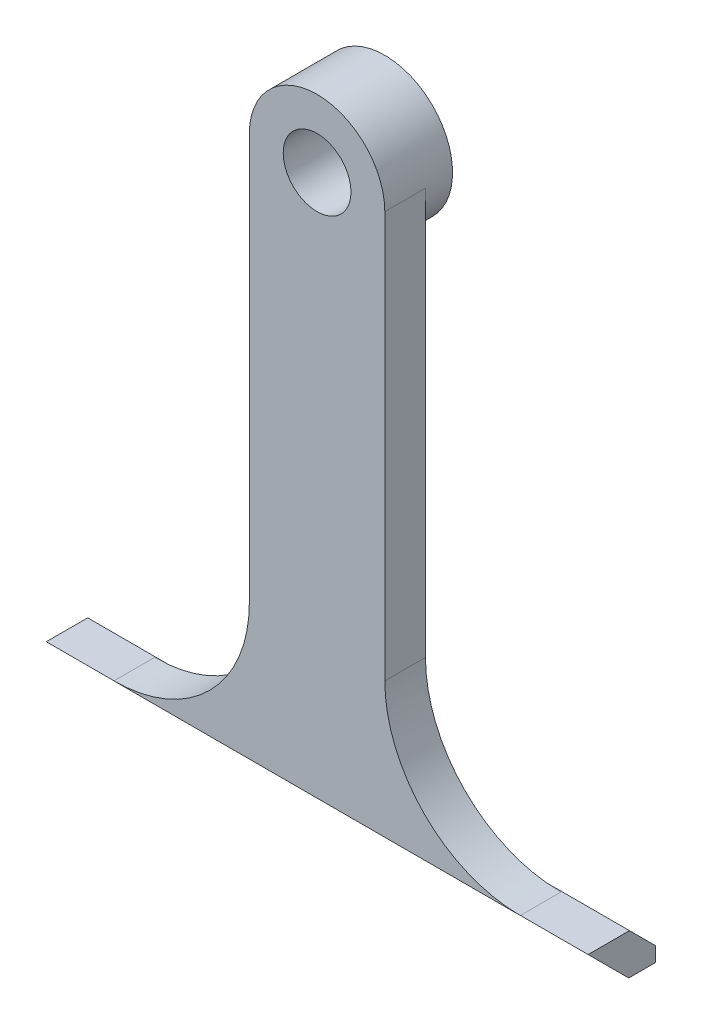
ISO-10303-21;
HEADER;
FILE_DESCRIPTION(('STEP AP214'),'2;1');
FILE_NAME('part.step','',(''),(''),'','','');
FILE_SCHEMA(('AUTOMOTIVE_DESIGN { 1 0 10303 214 1 1 1 1 }'));
ENDSEC;
DATA;
#1=APPLICATION_CONTEXT('core data for automotive mechanical design processes');
#2=APPLICATION_PROTOCOL_DEFINITION('international standard','automotive_design',2000,#1);
#3=PRODUCT_CONTEXT('',#1,'mechanical');
#4=PRODUCT('Part','Part','',(#3));
#5=PRODUCT_RELATED_PRODUCT_CATEGORY('part','',(#4));
#6=PRODUCT_DEFINITION_FORMATION('','',#4);
#7=PRODUCT_DEFINITION_CONTEXT('part definition',#1,'design');
#8=PRODUCT_DEFINITION('design','',#6,#7);
#9=PRODUCT_DEFINITION_SHAPE('','',#8);
#10=(LENGTH_UNIT() NAMED_UNIT(*) SI_UNIT(.MILLI.,.METRE.));
#11=(NAMED_UNIT(*) PLANE_ANGLE_UNIT() SI_UNIT($,.RADIAN.));
#12=(NAMED_UNIT(*) SI_UNIT($,.STERADIAN.) SOLID_ANGLE_UNIT());
#13=UNCERTAINTY_MEASURE_WITH_UNIT(LENGTH_MEASURE(1.E-05),#10,'distance_accuracy_value','');
#14=(GEOMETRIC_REPRESENTATION_CONTEXT(3) GLOBAL_UNCERTAINTY_ASSIGNED_CONTEXT((#13)) GLOBAL_UNIT_ASSIGNED_CONTEXT((#10,
#11,#12)) REPRESENTATION_CONTEXT('',''));
#15=CARTESIAN_POINT('',(0.,0.,0.));
#16=DIRECTION('',(0.,0.,1.));
#17=DIRECTION('',(1.,0.,0.));
#18=AXIS2_PLACEMENT_3D('',#15,#16,#17);
#19=CARTESIAN_POINT('',(0.,0.,-20.32));
#20=DIRECTION('',(0.,0.,-1.));
#21=DIRECTION('',(-1.,0.,0.));
#22=AXIS2_PLACEMENT_3D('',#19,#20,#21);
#23=PLANE('',#22);
#24=DIRECTION('',(0.,-1.,0.));
#25=VECTOR('',#24,1.);
#26=CARTESIAN_POINT('',(-12.7,0.,-20.32));
#27=LINE('',#26,#25);
#28=CARTESIAN_POINT('',(-12.7,109.22,-20.32));
#29=VERTEX_POINT('',#28);
#30=CARTESIAN_POINT('',(-12.7,33.02,-20.32));
#31=VERTEX_POINT('',#30);
#32=EDGE_CURVE('E262',#29,#31,#27,.T.);
#33=ORIENTED_EDGE('',*,*,#32,.F.);
#34=CARTESIAN_POINT('',(0.,109.22,-20.32));
#35=DIRECTION('',(0.,0.,-1.));
#36=DIRECTION('',(-1.,0.,0.));
#37=AXIS2_PLACEMENT_3D('',#34,#35,#36);
#38=CIRCLE('',#37,12.7);
#39=CARTESIAN_POINT('',(12.7,109.22,-20.32));
#40=VERTEX_POINT('',#39);
#41=EDGE_CURVE('E207',#29,#40,#38,.F.);
#42=ORIENTED_EDGE('',*,*,#41,.T.);
#43=DIRECTION('',(0.,-1.,0.));
#44=VECTOR('',#43,1.);
#45=CARTESIAN_POINT('',(12.7,0.,-20.32));
#46=LINE('',#45,#44);
#47=CARTESIAN_POINT('',(12.7,33.02,-20.32));
#48=VERTEX_POINT('',#47);
#49=EDGE_CURVE('E259',#40,#48,#46,.T.);
#50=ORIENTED_EDGE('',*,*,#49,.T.);
#51=CARTESIAN_POINT('',(38.1,33.02,-20.32));
#52=DIRECTION('',(0.,0.,-1.));
#53=DIRECTION('',(-1.,0.,0.));
#54=AXIS2_PLACEMENT_3D('',#51,#52,#53);
#55=CIRCLE('',#54,25.4);
#56=CARTESIAN_POINT('',(38.1,7.62,-20.32));
#57=VERTEX_POINT('',#56);
#58=EDGE_CURVE('E229',#48,#57,#55,.F.);
#59=ORIENTED_EDGE('',*,*,#58,.T.);
#60=DIRECTION('',(1.,0.,0.));
#61=VECTOR('',#60,1.);
#62=CARTESIAN_POINT('',(0.,7.62,-20.32));
#63=LINE('',#62,#61);
#64=CARTESIAN_POINT('',(-38.1,7.62,-20.32));
#65=VERTEX_POINT('',#64);
#66=EDGE_CURVE('E256',#65,#57,#63,.T.);
#67=ORIENTED_EDGE('',*,*,#66,.F.);
#68=CARTESIAN_POINT('',(-38.1,33.02,-20.32));
#69=DIRECTION('',(0.,0.,-1.));
#70=DIRECTION('',(-1.,0.,0.));
#71=AXIS2_PLACEMENT_3D('',#68,#69,#70);
#72=CIRCLE('',#71,25.4);
#73=EDGE_CURVE('E224',#65,#31,#72,.F.);
#74=ORIENTED_EDGE('',*,*,#73,.T.);
#75=EDGE_LOOP('',(#33,#42,#50,#59,#67,#74));
#76=FACE_BOUND('',#75,.T.);
#77=ADVANCED_FACE('F83',(#76),#23,.T.);
#78=CARTESIAN_POINT('',(25.4,7.62,0.));
#79=DIRECTION('',(0.,1.,0.));
#80=DIRECTION('',(0.,0.,1.));
#81=AXIS2_PLACEMENT_3D('',#78,#79,#80);
#82=PLANE('',#81);
#83=DIRECTION('',(1.,0.,0.));
#84=VECTOR('',#83,1.);
#85=CARTESIAN_POINT('',(-50.8,7.62,-12.7175408770439));
#86=LINE('',#85,#84);
#87=CARTESIAN_POINT('',(38.1,7.62,-12.7175408770439));
#88=VERTEX_POINT('',#87);
#89=CARTESIAN_POINT('',(50.8,7.62,-12.7175408770439));
#90=VERTEX_POINT('',#89);
#91=EDGE_CURVE('E192',#88,#90,#86,.T.);
#92=ORIENTED_EDGE('',*,*,#91,.T.);
#93=DIRECTION('',(0.,0.,1.));
#94=VECTOR('',#93,1.);
#95=CARTESIAN_POINT('',(50.8,7.62,-25.4));
#96=LINE('',#95,#94);
#97=CARTESIAN_POINT('',(50.8,7.62,-20.48));
#98=VERTEX_POINT('',#97);
#99=EDGE_CURVE('E197',#98,#90,#96,.T.);
#100=ORIENTED_EDGE('',*,*,#99,.F.);
#101=DIRECTION('',(-1.,0.,0.));
#102=VECTOR('',#101,1.);
#103=CARTESIAN_POINT('',(25.4,7.62,-20.48));
#104=LINE('',#103,#102);
#105=CARTESIAN_POINT('',(-50.8,7.62,-20.48));
#106=VERTEX_POINT('',#105);
#107=EDGE_CURVE('E92',#98,#106,#104,.T.);
#108=ORIENTED_EDGE('',*,*,#107,.T.);
#109=DIRECTION('',(0.,0.,1.));
#110=VECTOR('',#109,1.);
#111=CARTESIAN_POINT('',(-50.8,7.62,-25.4));
#112=LINE('',#111,#110);
#113=CARTESIAN_POINT('',(-50.8,7.62,-12.7175408770439));
#114=VERTEX_POINT('',#113);
#115=EDGE_CURVE('E200',#106,#114,#112,.T.);
#116=ORIENTED_EDGE('',*,*,#115,.T.);
#117=CARTESIAN_POINT('',(-38.1,7.62,-12.7175408770439));
#118=VERTEX_POINT('',#117);
#119=EDGE_CURVE('E178',#114,#118,#86,.T.);
#120=ORIENTED_EDGE('',*,*,#119,.T.);
#121=DIRECTION('',(0.,0.,-1.));
#122=VECTOR('',#121,1.);
#123=CARTESIAN_POINT('',(-38.1,7.62,0.));
#124=LINE('',#123,#122);
#125=EDGE_CURVE('E216',#118,#65,#124,.T.);
#126=ORIENTED_EDGE('',*,*,#125,.T.);
#127=ORIENTED_EDGE('',*,*,#66,.T.);
#128=DIRECTION('',(0.,0.,-1.));
#129=VECTOR('',#128,1.);
#130=CARTESIAN_POINT('',(38.1,7.62,-12.7));
#131=LINE('',#130,#129);
#132=EDGE_CURVE('E213',#57,#88,#131,.F.);
#133=ORIENTED_EDGE('',*,*,#132,.T.);
#134=EDGE_LOOP('',(#92,#100,#108,#116,#120,#126,#127,#133));
#135=FACE_BOUND('',#134,.T.);
#136=ADVANCED_FACE('F244',(#135),#82,.T.);
#137=CARTESIAN_POINT('',(25.4,0.,0.));
#138=DIRECTION('',(0.,1.,0.));
#139=DIRECTION('',(0.,0.,1.));
#140=AXIS2_PLACEMENT_3D('',#137,#138,#139);
#141=PLANE('',#140);
#142=DIRECTION('',(0.,0.,1.));
#143=VECTOR('',#142,1.);
#144=CARTESIAN_POINT('',(50.8,0.,-25.4));
#145=LINE('',#144,#143);
#146=CARTESIAN_POINT('',(50.8,0.,-25.4));
#147=VERTEX_POINT('',#146);
#148=CARTESIAN_POINT('',(50.8,0.,-20.3375408770441));
#149=VERTEX_POINT('',#148);
#150=EDGE_CURVE('E191',#147,#149,#145,.T.);
#151=ORIENTED_EDGE('',*,*,#150,.T.);
#152=DIRECTION('',(1.,0.,0.));
#153=VECTOR('',#152,1.);
#154=CARTESIAN_POINT('',(-50.8,0.,-20.3375408770441));
#155=LINE('',#154,#153);
#156=CARTESIAN_POINT('',(-50.8,0.,-20.3375408770441));
#157=VERTEX_POINT('',#156);
#158=EDGE_CURVE('E175',#157,#149,#155,.T.);
#159=ORIENTED_EDGE('',*,*,#158,.F.);
#160=DIRECTION('',(0.,0.,1.));
#161=VECTOR('',#160,1.);
#162=CARTESIAN_POINT('',(-50.8,0.,-25.4));
#163=LINE('',#162,#161);
#164=CARTESIAN_POINT('',(-50.8,0.,-25.4));
#165=VERTEX_POINT('',#164);
#166=EDGE_CURVE('E188',#165,#157,#163,.T.);
#167=ORIENTED_EDGE('',*,*,#166,.F.);
#168=DIRECTION('',(1.,0.,0.));
#169=VECTOR('',#168,1.);
#170=CARTESIAN_POINT('',(-50.8,0.,-25.4));
#171=LINE('',#170,#169);
#172=EDGE_CURVE('E202',#165,#147,#171,.T.);
#173=ORIENTED_EDGE('',*,*,#172,.T.);
#174=EDGE_LOOP('',(#151,#159,#167,#173));
#175=FACE_BOUND('',#174,.T.);
#176=ADVANCED_FACE('F186',(#175),#141,.F.);
#177=CARTESIAN_POINT('',(-50.8,7.62,-25.4));
#178=DIRECTION('',(0.,0.,-1.));
#179=DIRECTION('',(-1.,0.,0.));
#180=AXIS2_PLACEMENT_3D('',#177,#178,#179);
#181=PLANE('',#180);
#182=DIRECTION('',(0.,-1.,0.));
#183=VECTOR('',#182,1.);
#184=CARTESIAN_POINT('',(-50.8,7.62,-25.4));
#185=LINE('',#184,#183);
#186=CARTESIAN_POINT('',(-50.8,2.69999999999999,-25.4));
#187=VERTEX_POINT('',#186);
#188=EDGE_CURVE('E196',#187,#165,#185,.T.);
#189=ORIENTED_EDGE('',*,*,#188,.F.);
#190=DIRECTION('',(1.,0.,0.));
#191=VECTOR('',#190,1.);
#192=CARTESIAN_POINT('',(-50.8,2.69999999999999,-25.4));
#193=LINE('',#192,#191);
#194=CARTESIAN_POINT('',(50.8,2.69999999999999,-25.4));
#195=VERTEX_POINT('',#194);
#196=EDGE_CURVE('E234',#187,#195,#193,.T.);
#197=ORIENTED_EDGE('',*,*,#196,.T.);
#198=DIRECTION('',(0.,-1.,0.));
#199=VECTOR('',#198,1.);
#200=CARTESIAN_POINT('',(50.8,7.62,-25.4));
#201=LINE('',#200,#199);
#202=EDGE_CURVE('E208',#195,#147,#201,.T.);
#203=ORIENTED_EDGE('',*,*,#202,.T.);
#204=ORIENTED_EDGE('',*,*,#172,.F.);
#205=EDGE_LOOP('',(#189,#197,#203,#204));
#206=FACE_BOUND('',#205,.T.);
#207=ADVANCED_FACE('F247',(#206),#181,.T.);
#208=CARTESIAN_POINT('',(-50.8,7.62,-25.4));
#209=DIRECTION('',(1.,0.,0.));
#210=DIRECTION('',(0.,0.,-1.));
#211=AXIS2_PLACEMENT_3D('',#208,#209,#210);
#212=PLANE('',#211);
#213=ORIENTED_EDGE('',*,*,#166,.T.);
#214=DIRECTION('',(0.,0.707106781186539,0.707106781186556));
#215=VECTOR('',#214,1.);
#216=CARTESIAN_POINT('',(-50.8,7.62,-12.7175408770439));
#217=LINE('',#216,#215);
#218=EDGE_CURVE('E172',#157,#114,#217,.T.);
#219=ORIENTED_EDGE('',*,*,#218,.T.);
#220=ORIENTED_EDGE('',*,*,#115,.F.);
#221=DIRECTION('',(0.,0.707106781186547,0.707106781186548));
#222=VECTOR('',#221,1.);
#223=CARTESIAN_POINT('',(-50.8,2.69999999999999,-25.4));
#224=LINE('',#223,#222);
#225=EDGE_CURVE('E12',#106,#187,#224,.F.);
#226=ORIENTED_EDGE('',*,*,#225,.T.);
#227=ORIENTED_EDGE('',*,*,#188,.T.);
#228=EDGE_LOOP('',(#213,#219,#220,#226,#227));
#229=FACE_BOUND('',#228,.T.);
#230=ADVANCED_FACE('F194',(#229),#212,.F.);
#231=CARTESIAN_POINT('',(50.8,7.62,-25.4));
#232=DIRECTION('',(1.,0.,0.));
#233=DIRECTION('',(0.,0.,-1.));
#234=AXIS2_PLACEMENT_3D('',#231,#232,#233);
#235=PLANE('',#234);
#236=DIRECTION('',(0.,0.707106781186539,0.707106781186556));
#237=VECTOR('',#236,1.);
#238=CARTESIAN_POINT('',(50.8,7.62,-12.7175408770439));
#239=LINE('',#238,#237);
#240=EDGE_CURVE('E181',#149,#90,#239,.T.);
#241=ORIENTED_EDGE('',*,*,#240,.F.);
#242=ORIENTED_EDGE('',*,*,#150,.F.);
#243=ORIENTED_EDGE('',*,*,#202,.F.);
#244=DIRECTION('',(0.,-0.707106781186547,-0.707106781186548));
#245=VECTOR('',#244,1.);
#246=CARTESIAN_POINT('',(50.8,5.15999999999999,-22.94));
#247=LINE('',#246,#245);
#248=EDGE_CURVE('E237',#195,#98,#247,.F.);
#249=ORIENTED_EDGE('',*,*,#248,.T.);
#250=ORIENTED_EDGE('',*,*,#99,.T.);
#251=EDGE_LOOP('',(#241,#242,#243,#249,#250));
#252=FACE_BOUND('',#251,.T.);
#253=ADVANCED_FACE('F240',(#252),#235,.T.);
#254=CARTESIAN_POINT('',(-12.7,0.,-12.7));
#255=DIRECTION('',(1.,0.,0.));
#256=DIRECTION('',(0.,1.,0.));
#257=AXIS2_PLACEMENT_3D('',#254,#255,#256);
#258=PLANE('',#257);
#259=ORIENTED_EDGE('',*,*,#32,.T.);
#260=DIRECTION('',(0.,0.,-1.));
#261=VECTOR('',#260,1.);
#262=CARTESIAN_POINT('',(-12.7,33.02,-12.7));
#263=LINE('',#262,#261);
#264=CARTESIAN_POINT('',(-12.7,33.02,-12.7));
#265=VERTEX_POINT('',#264);
#266=EDGE_CURVE('E219',#31,#265,#263,.F.);
#267=ORIENTED_EDGE('',*,*,#266,.T.);
#268=DIRECTION('',(0.,-1.,0.));
#269=VECTOR('',#268,1.);
#270=CARTESIAN_POINT('',(-12.7,0.,-12.7));
#271=LINE('',#270,#269);
#272=CARTESIAN_POINT('',(-12.7,109.22,-12.7));
#273=VERTEX_POINT('',#272);
#274=EDGE_CURVE('E258',#273,#265,#271,.T.);
#275=ORIENTED_EDGE('',*,*,#274,.F.);
#276=DIRECTION('',(0.,0.,-1.));
#277=VECTOR('',#276,1.);
#278=CARTESIAN_POINT('',(-12.7,109.22,-12.7));
#279=LINE('',#278,#277);
#280=EDGE_CURVE('E250',#273,#29,#279,.T.);
#281=ORIENTED_EDGE('',*,*,#280,.T.);
#282=EDGE_LOOP('',(#259,#267,#275,#281));
#283=FACE_BOUND('',#282,.T.);
#284=ADVANCED_FACE('F309',(#283),#258,.F.);
#285=CARTESIAN_POINT('',(12.7,0.,-12.7));
#286=DIRECTION('',(1.,0.,0.));
#287=DIRECTION('',(0.,1.,0.));
#288=AXIS2_PLACEMENT_3D('',#285,#286,#287);
#289=PLANE('',#288);
#290=DIRECTION('',(0.,-1.,0.));
#291=VECTOR('',#290,1.);
#292=CARTESIAN_POINT('',(12.7,0.,-12.7));
#293=LINE('',#292,#291);
#294=CARTESIAN_POINT('',(12.7,109.22,-12.7));
#295=VERTEX_POINT('',#294);
#296=CARTESIAN_POINT('',(12.7,33.02,-12.7));
#297=VERTEX_POINT('',#296);
#298=EDGE_CURVE('E271',#295,#297,#293,.T.);
#299=ORIENTED_EDGE('',*,*,#298,.T.);
#300=DIRECTION('',(0.,0.,-1.));
#301=VECTOR('',#300,1.);
#302=CARTESIAN_POINT('',(12.7,33.02,-20.32));
#303=LINE('',#302,#301);
#304=EDGE_CURVE('E221',#297,#48,#303,.T.);
#305=ORIENTED_EDGE('',*,*,#304,.T.);
#306=ORIENTED_EDGE('',*,*,#49,.F.);
#307=DIRECTION('',(0.,0.,-1.));
#308=VECTOR('',#307,1.);
#309=CARTESIAN_POINT('',(12.7,109.22,-12.7));
#310=LINE('',#309,#308);
#311=EDGE_CURVE('E248',#295,#40,#310,.T.);
#312=ORIENTED_EDGE('',*,*,#311,.F.);
#313=EDGE_LOOP('',(#299,#305,#306,#312));
#314=FACE_BOUND('',#313,.T.);
#315=ADVANCED_FACE('F297',(#314),#289,.T.);
#316=CARTESIAN_POINT('',(0.,109.22,-12.7));
#317=DIRECTION('',(0.,0.,-1.));
#318=DIRECTION('',(-1.,0.,0.));
#319=AXIS2_PLACEMENT_3D('',#316,#317,#318);
#320=CYLINDRICAL_SURFACE('',#319,12.7);
#321=ORIENTED_EDGE('',*,*,#311,.T.);
#322=ORIENTED_EDGE('',*,*,#41,.F.);
#323=ORIENTED_EDGE('',*,*,#280,.F.);
#324=CARTESIAN_POINT('',(0.,109.22,-12.7));
#325=DIRECTION('',(0.,0.,-1.));
#326=DIRECTION('',(-1.,0.,0.));
#327=AXIS2_PLACEMENT_3D('',#324,#325,#326);
#328=CIRCLE('',#327,12.7);
#329=EDGE_CURVE('E274',#273,#295,#328,.T.);
#330=ORIENTED_EDGE('',*,*,#329,.T.);
#331=EDGE_LOOP('',(#321,#322,#323,#330));
#332=FACE_BOUND('',#331,.T.);
#333=CARTESIAN_POINT('',(0.,109.22,-25.4));
#334=DIRECTION('',(0.,0.,-1.));
#335=DIRECTION('',(-1.,0.,0.));
#336=AXIS2_PLACEMENT_3D('',#333,#334,#335);
#337=CIRCLE('',#336,12.7);
#338=CARTESIAN_POINT('',(-12.7,109.22,-25.4));
#339=VERTEX_POINT('',#338);
#340=EDGE_CURVE('E265',#339,#339,#337,.T.);
#341=ORIENTED_EDGE('',*,*,#340,.F.);
#342=EDGE_LOOP('',(#341));
#343=FACE_BOUND('',#342,.T.);
#344=ADVANCED_FACE('F304',(#332,#343),#320,.T.);
#345=CARTESIAN_POINT('',(0.,109.22,-12.7));
#346=DIRECTION('',(0.,0.,-1.));
#347=DIRECTION('',(-1.,0.,0.));
#348=AXIS2_PLACEMENT_3D('',#345,#346,#347);
#349=CYLINDRICAL_SURFACE('',#348,6.35);
#350=CARTESIAN_POINT('',(0.,109.22,-12.7));
#351=DIRECTION('',(0.,0.,-1.));
#352=DIRECTION('',(-1.,0.,0.));
#353=AXIS2_PLACEMENT_3D('',#350,#351,#352);
#354=CIRCLE('',#353,6.35);
#355=CARTESIAN_POINT('',(-6.34999999999999,109.22,-12.7));
#356=VERTEX_POINT('',#355);
#357=EDGE_CURVE('E254',#356,#356,#354,.T.);
#358=CARTESIAN_POINT('',(0.,109.22,-25.4));
#359=DIRECTION('',(0.,0.,-1.));
#360=DIRECTION('',(-1.,0.,0.));
#361=AXIS2_PLACEMENT_3D('',#358,#359,#360);
#362=CIRCLE('',#361,6.35);
#363=CARTESIAN_POINT('',(-6.34999999999999,109.22,-25.4));
#364=VERTEX_POINT('',#363);
#365=EDGE_CURVE('E281',#364,#364,#362,.T.);
#366=CARTESIAN_POINT('',(-6.34999999999999,109.22,-12.7));
#367=CARTESIAN_POINT('',(-6.34999999999999,109.22,-12.8322916666667));
#368=CARTESIAN_POINT('',(-6.34999999999999,109.22,-12.9645833333333));
#369=CARTESIAN_POINT('',(-6.34999999999999,109.22,-13.2291666666667));
#370=CARTESIAN_POINT('',(-6.34999999999999,109.22,-13.3614583333333));
#371=CARTESIAN_POINT('',(-6.34999999999999,109.22,-13.6260416666667));
#372=CARTESIAN_POINT('',(-6.34999999999999,109.22,-13.7583333333333));
#373=CARTESIAN_POINT('',(-6.34999999999999,109.22,-14.0229166666667));
#374=CARTESIAN_POINT('',(-6.34999999999999,109.22,-14.1552083333333));
#375=CARTESIAN_POINT('',(-6.34999999999999,109.22,-14.4197916666667));
#376=CARTESIAN_POINT('',(-6.34999999999999,109.22,-14.5520833333333));
#377=CARTESIAN_POINT('',(-6.34999999999999,109.22,-14.8166666666667));
#378=CARTESIAN_POINT('',(-6.34999999999999,109.22,-14.9489583333333));
#379=CARTESIAN_POINT('',(-6.34999999999999,109.22,-15.2135416666667));
#380=CARTESIAN_POINT('',(-6.34999999999999,109.22,-15.3458333333333));
#381=CARTESIAN_POINT('',(-6.34999999999999,109.22,-15.6104166666667));
#382=CARTESIAN_POINT('',(-6.34999999999999,109.22,-15.7427083333333));
#383=CARTESIAN_POINT('',(-6.34999999999999,109.22,-16.0072916666667));
#384=CARTESIAN_POINT('',(-6.34999999999999,109.22,-16.1395833333333));
#385=CARTESIAN_POINT('',(-6.34999999999999,109.22,-16.4041666666667));
#386=CARTESIAN_POINT('',(-6.34999999999999,109.22,-16.5364583333333));
#387=CARTESIAN_POINT('',(-6.34999999999999,109.22,-16.8010416666667));
#388=CARTESIAN_POINT('',(-6.34999999999999,109.22,-16.9333333333333));
#389=CARTESIAN_POINT('',(-6.34999999999999,109.22,-17.1979166666667));
#390=CARTESIAN_POINT('',(-6.34999999999999,109.22,-17.3302083333333));
#391=CARTESIAN_POINT('',(-6.34999999999999,109.22,-17.5947916666667));
#392=CARTESIAN_POINT('',(-6.34999999999999,109.22,-17.7270833333333));
#393=CARTESIAN_POINT('',(-6.34999999999999,109.22,-17.9916666666667));
#394=CARTESIAN_POINT('',(-6.34999999999999,109.22,-18.1239583333333));
#395=CARTESIAN_POINT('',(-6.34999999999999,109.22,-18.3885416666667));
#396=CARTESIAN_POINT('',(-6.34999999999999,109.22,-18.5208333333333));
#397=CARTESIAN_POINT('',(-6.34999999999999,109.22,-18.7854166666667));
#398=CARTESIAN_POINT('',(-6.34999999999999,109.22,-18.9177083333333));
#399=CARTESIAN_POINT('',(-6.34999999999999,109.22,-19.1822916666667));
#400=CARTESIAN_POINT('',(-6.34999999999999,109.22,-19.3145833333333));
#401=CARTESIAN_POINT('',(-6.34999999999999,109.22,-19.5791666666667));
#402=CARTESIAN_POINT('',(-6.34999999999999,109.22,-19.7114583333333));
#403=CARTESIAN_POINT('',(-6.34999999999999,109.22,-19.9760416666667));
#404=CARTESIAN_POINT('',(-6.34999999999999,109.22,-20.1083333333333));
#405=CARTESIAN_POINT('',(-6.34999999999999,109.22,-20.3729166666667));
#406=CARTESIAN_POINT('',(-6.34999999999999,109.22,-20.5052083333333));
#407=CARTESIAN_POINT('',(-6.34999999999999,109.22,-20.7697916666667));
#408=CARTESIAN_POINT('',(-6.34999999999999,109.22,-20.9020833333333));
#409=CARTESIAN_POINT('',(-6.34999999999999,109.22,-21.1666666666667));
#410=CARTESIAN_POINT('',(-6.34999999999999,109.22,-21.2989583333333));
#411=CARTESIAN_POINT('',(-6.34999999999999,109.22,-21.5635416666667));
#412=CARTESIAN_POINT('',(-6.34999999999999,109.22,-21.6958333333333));
#413=CARTESIAN_POINT('',(-6.34999999999999,109.22,-21.9604166666667));
#414=CARTESIAN_POINT('',(-6.34999999999999,109.22,-22.0927083333333));
#415=CARTESIAN_POINT('',(-6.34999999999999,109.22,-22.3572916666667));
#416=CARTESIAN_POINT('',(-6.34999999999999,109.22,-22.4895833333333));
#417=CARTESIAN_POINT('',(-6.34999999999999,109.22,-22.7541666666667));
#418=CARTESIAN_POINT('',(-6.34999999999999,109.22,-22.8864583333333));
#419=CARTESIAN_POINT('',(-6.34999999999999,109.22,-23.1510416666667));
#420=CARTESIAN_POINT('',(-6.34999999999999,109.22,-23.2833333333333));
#421=CARTESIAN_POINT('',(-6.34999999999999,109.22,-23.5479166666667));
#422=CARTESIAN_POINT('',(-6.34999999999999,109.22,-23.6802083333333));
#423=CARTESIAN_POINT('',(-6.34999999999999,109.22,-23.9447916666667));
#424=CARTESIAN_POINT('',(-6.34999999999999,109.22,-24.0770833333333));
#425=CARTESIAN_POINT('',(-6.34999999999999,109.22,-24.3416666666667));
#426=CARTESIAN_POINT('',(-6.34999999999999,109.22,-24.4739583333333));
#427=CARTESIAN_POINT('',(-6.34999999999999,109.22,-24.7385416666667));
#428=CARTESIAN_POINT('',(-6.34999999999999,109.22,-24.8708333333333));
#429=CARTESIAN_POINT('',(-6.34999999999999,109.22,-25.1354166666667));
#430=CARTESIAN_POINT('',(-6.34999999999999,109.22,-25.2677083333333));
#431=CARTESIAN_POINT('',(-6.34999999999999,109.22,-25.4));
#432=B_SPLINE_CURVE_WITH_KNOTS('',3,(#366,#367,#368,#369,#370,#371,#372,#373,#374,#375,#376,
#377,#378,#379,#380,#381,#382,#383,#384,#385,#386,#387,#388,#389,#390,#391,#392,#393,#394,#395,
#396,#397,#398,#399,#400,#401,#402,#403,#404,#405,#406,#407,#408,#409,#410,#411,#412,#413,#414,
#415,#416,#417,#418,#419,#420,#421,#422,#423,#424,#425,#426,#427,#428,#429,#430,#431),
.UNSPECIFIED.,.F.,.F.,(4,2,2,2,2,2,2,2,2,2,2,2,2,2,2,2,2,2,2,2,2,2,2,2,2,2,2,2,2,2,2,2,4),(0.,
0.396875,0.793749999999999,1.190625,1.5875,1.984375,2.38125,2.778125,3.175,3.571875,3.96875,
4.36562499999999,4.7625,5.159375,5.55625,5.95312499999999,6.34999999999999,6.746875,
7.14374999999999,7.54062499999999,7.93749999999999,8.33437499999999,8.73124999999999,
9.12812499999999,9.525,9.92187499999999,10.31875,10.715625,11.1125,11.509375,11.90625,12.303125,
12.7),.UNSPECIFIED.);
#433=EDGE_CURVE('BSEAM332',#356,#364,#432,.T.);
#434=ORIENTED_EDGE('',*,*,#357,.F.);
#435=ORIENTED_EDGE('',*,*,#365,.T.);
#436=ORIENTED_EDGE('',*,*,#433,.T.);
#437=ORIENTED_EDGE('',*,*,#433,.F.);
#438=EDGE_LOOP('',(#434,#436,#435,#437));
#439=FACE_BOUND('',#438,.T.);
#440=ADVANCED_FACE('F332',(#439),#349,.F.);
#441=CARTESIAN_POINT('',(0.,0.,-12.7));
#442=DIRECTION('',(0.,0.,-1.));
#443=DIRECTION('',(-1.,0.,0.));
#444=AXIS2_PLACEMENT_3D('',#441,#442,#443);
#445=PLANE('',#444);
#446=ORIENTED_EDGE('',*,*,#274,.T.);
#447=CARTESIAN_POINT('',(-38.1,33.02,-12.7));
#448=DIRECTION('',(0.,0.,-1.));
#449=DIRECTION('',(-1.,0.,0.));
#450=AXIS2_PLACEMENT_3D('',#447,#448,#449);
#451=CIRCLE('',#450,25.4);
#452=CARTESIAN_POINT('',(-38.1,7.62,-12.7));
#453=VERTEX_POINT('',#452);
#454=EDGE_CURVE('E226',#265,#453,#451,.T.);
#455=ORIENTED_EDGE('',*,*,#454,.T.);
#456=DIRECTION('',(1.,0.,0.));
#457=VECTOR('',#456,1.);
#458=CARTESIAN_POINT('',(0.,7.62,-12.7));
#459=LINE('',#458,#457);
#460=CARTESIAN_POINT('',(38.1,7.62,-12.7));
#461=VERTEX_POINT('',#460);
#462=EDGE_CURVE('E268',#453,#461,#459,.T.);
#463=ORIENTED_EDGE('',*,*,#462,.T.);
#464=CARTESIAN_POINT('',(38.1,33.02,-12.7));
#465=DIRECTION('',(0.,0.,-1.));
#466=DIRECTION('',(-1.,0.,0.));
#467=AXIS2_PLACEMENT_3D('',#464,#465,#466);
#468=CIRCLE('',#467,25.4);
#469=EDGE_CURVE('E232',#461,#297,#468,.T.);
#470=ORIENTED_EDGE('',*,*,#469,.T.);
#471=ORIENTED_EDGE('',*,*,#298,.F.);
#472=ORIENTED_EDGE('',*,*,#329,.F.);
#473=EDGE_LOOP('',(#446,#455,#463,#470,#471,#472));
#474=FACE_BOUND('',#473,.T.);
#475=ORIENTED_EDGE('',*,*,#357,.T.);
#476=EDGE_LOOP('',(#475));
#477=FACE_BOUND('',#476,.T.);
#478=ADVANCED_FACE('F301',(#474,#477),#445,.F.);
#479=CARTESIAN_POINT('',(0.,0.,-25.4));
#480=DIRECTION('',(0.,0.,-1.));
#481=DIRECTION('',(-1.,0.,0.));
#482=AXIS2_PLACEMENT_3D('',#479,#480,#481);
#483=PLANE('',#482);
#484=ORIENTED_EDGE('',*,*,#365,.F.);
#485=EDGE_LOOP('',(#484));
#486=FACE_BOUND('',#485,.T.);
#487=ORIENTED_EDGE('',*,*,#340,.T.);
#488=EDGE_LOOP('',(#487));
#489=FACE_BOUND('',#488,.T.);
#490=ADVANCED_FACE('F351',(#486,#489),#483,.T.);
#491=CARTESIAN_POINT('',(-38.1,33.02,0.));
#492=DIRECTION('',(0.,0.,-1.));
#493=DIRECTION('',(-1.,0.,0.));
#494=AXIS2_PLACEMENT_3D('',#491,#492,#493);
#495=CYLINDRICAL_SURFACE('',#494,25.4);
#496=ORIENTED_EDGE('',*,*,#454,.F.);
#497=ORIENTED_EDGE('',*,*,#266,.F.);
#498=ORIENTED_EDGE('',*,*,#73,.F.);
#499=ORIENTED_EDGE('',*,*,#125,.F.);
#500=EDGE_CURVE('E217',#453,#118,#124,.T.);
#501=ORIENTED_EDGE('',*,*,#500,.F.);
#502=EDGE_LOOP('',(#496,#497,#498,#499,#501));
#503=FACE_BOUND('',#502,.T.);
#504=ADVANCED_FACE('F314',(#503),#495,.F.);
#505=CARTESIAN_POINT('',(38.1,33.02,-12.7));
#506=DIRECTION('',(0.,0.,1.));
#507=DIRECTION('',(1.,0.,0.));
#508=AXIS2_PLACEMENT_3D('',#505,#506,#507);
#509=CYLINDRICAL_SURFACE('',#508,25.4);
#510=ORIENTED_EDGE('',*,*,#469,.F.);
#511=EDGE_CURVE('E212',#88,#461,#131,.F.);
#512=ORIENTED_EDGE('',*,*,#511,.F.);
#513=ORIENTED_EDGE('',*,*,#132,.F.);
#514=ORIENTED_EDGE('',*,*,#58,.F.);
#515=ORIENTED_EDGE('',*,*,#304,.F.);
#516=EDGE_LOOP('',(#510,#512,#513,#514,#515));
#517=FACE_BOUND('',#516,.T.);
#518=ADVANCED_FACE('F289',(#517),#509,.F.);
#519=CARTESIAN_POINT('',(-50.8,2.69999999999999,-25.4));
#520=DIRECTION('',(0.,-0.707106781186548,0.707106781186547));
#521=DIRECTION('',(1.,0.,0.));
#522=AXIS2_PLACEMENT_3D('',#519,#520,#521);
#523=PLANE('',#522);
#524=ORIENTED_EDGE('',*,*,#225,.F.);
#525=ORIENTED_EDGE('',*,*,#107,.F.);
#526=ORIENTED_EDGE('',*,*,#248,.F.);
#527=ORIENTED_EDGE('',*,*,#196,.F.);
#528=EDGE_LOOP('',(#524,#525,#526,#527));
#529=FACE_BOUND('',#528,.T.);
#530=ADVANCED_FACE('F86',(#529),#523,.F.);
#531=CARTESIAN_POINT('',(-50.8,7.62,-12.7175408770439));
#532=DIRECTION('',(0.,1.,0.));
#533=DIRECTION('',(0.,0.,1.));
#534=AXIS2_PLACEMENT_3D('',#531,#532,#533);
#535=PLANE('',#534);
#536=EDGE_CURVE('E99',#118,#88,#86,.T.);
#537=ORIENTED_EDGE('',*,*,#536,.T.);
#538=ORIENTED_EDGE('',*,*,#511,.T.);
#539=ORIENTED_EDGE('',*,*,#462,.F.);
#540=ORIENTED_EDGE('',*,*,#500,.T.);
#541=EDGE_LOOP('',(#537,#538,#539,#540));
#542=FACE_BOUND('',#541,.T.);
#543=ADVANCED_FACE('F315',(#542),#535,.F.);
#544=CARTESIAN_POINT('',(-50.8,7.62,-12.7175408770439));
#545=DIRECTION('',(0.,0.707106781186556,-0.707106781186539));
#546=DIRECTION('',(0.,0.707106781186539,0.707106781186556));
#547=AXIS2_PLACEMENT_3D('',#544,#545,#546);
#548=PLANE('',#547);
#549=ORIENTED_EDGE('',*,*,#240,.T.);
#550=ORIENTED_EDGE('',*,*,#91,.F.);
#551=ORIENTED_EDGE('',*,*,#536,.F.);
#552=ORIENTED_EDGE('',*,*,#119,.F.);
#553=ORIENTED_EDGE('',*,*,#218,.F.);
#554=ORIENTED_EDGE('',*,*,#158,.T.);
#555=EDGE_LOOP('',(#549,#550,#551,#552,#553,#554));
#556=FACE_BOUND('',#555,.T.);
#557=ADVANCED_FACE('F174',(#556),#548,.F.);
#558=CLOSED_SHELL('',(#77,#136,#176,#207,#230,#253,#284,#315,#344,#440,#478,#490,#504,#518,#530,
#543,#557));
#559=MANIFOLD_SOLID_BREP('B2',#558);
#560=ADVANCED_BREP_SHAPE_REPRESENTATION('',(#18,#559),#14);
#561=SHAPE_DEFINITION_REPRESENTATION(#9,#560);
ENDSEC;
END-ISO-10303-21;
